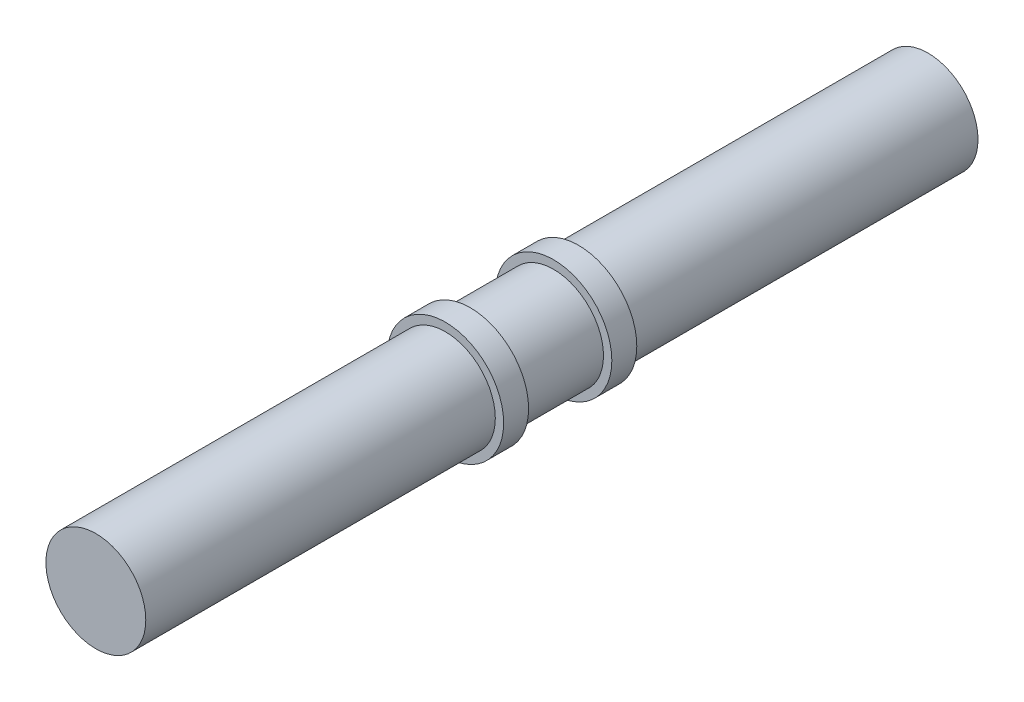
ISO-10303-21;
HEADER;
FILE_DESCRIPTION(('STEP AP214'),'2;1');
FILE_NAME('part.step','',(''),(''),'','','');
FILE_SCHEMA(('AUTOMOTIVE_DESIGN { 1 0 10303 214 1 1 1 1 }'));
ENDSEC;
DATA;
#1=APPLICATION_CONTEXT('core data for automotive mechanical design processes');
#2=APPLICATION_PROTOCOL_DEFINITION('international standard','automotive_design',2000,#1);
#3=PRODUCT_CONTEXT('',#1,'mechanical');
#4=PRODUCT('Part','Part','',(#3));
#5=PRODUCT_RELATED_PRODUCT_CATEGORY('part','',(#4));
#6=PRODUCT_DEFINITION_FORMATION('','',#4);
#7=PRODUCT_DEFINITION_CONTEXT('part definition',#1,'design');
#8=PRODUCT_DEFINITION('design','',#6,#7);
#9=PRODUCT_DEFINITION_SHAPE('','',#8);
#10=(LENGTH_UNIT() NAMED_UNIT(*) SI_UNIT(.MILLI.,.METRE.));
#11=(NAMED_UNIT(*) PLANE_ANGLE_UNIT() SI_UNIT($,.RADIAN.));
#12=(NAMED_UNIT(*) SI_UNIT($,.STERADIAN.) SOLID_ANGLE_UNIT());
#13=UNCERTAINTY_MEASURE_WITH_UNIT(LENGTH_MEASURE(1.E-05),#10,'distance_accuracy_value','');
#14=(GEOMETRIC_REPRESENTATION_CONTEXT(3) GLOBAL_UNCERTAINTY_ASSIGNED_CONTEXT((#13)) GLOBAL_UNIT_ASSIGNED_CONTEXT((#10,
#11,#12)) REPRESENTATION_CONTEXT('',''));
#15=CARTESIAN_POINT('',(0.,0.,0.));
#16=DIRECTION('',(0.,0.,1.));
#17=DIRECTION('',(1.,0.,0.));
#18=AXIS2_PLACEMENT_3D('',#15,#16,#17);
#19=CARTESIAN_POINT('',(0.,0.,42.));
#20=DIRECTION('',(0.,0.,-1.));
#21=DIRECTION('',(-1.,0.,0.));
#22=AXIS2_PLACEMENT_3D('',#19,#20,#21);
#23=CYLINDRICAL_SURFACE('',#22,6.);
#24=CARTESIAN_POINT('',(0.,0.,42.));
#25=DIRECTION('',(0.,0.,1.));
#26=DIRECTION('',(1.,0.,0.));
#27=AXIS2_PLACEMENT_3D('',#24,#25,#26);
#28=CIRCLE('',#27,6.);
#29=CARTESIAN_POINT('',(6.00000000000001,0.,42.));
#30=VERTEX_POINT('',#29);
#31=EDGE_CURVE('E56',#30,#30,#28,.T.);
#32=ORIENTED_EDGE('',*,*,#31,.F.);
#33=EDGE_LOOP('',(#32));
#34=FACE_BOUND('',#33,.T.);
#35=CARTESIAN_POINT('',(0.,0.,0.));
#36=DIRECTION('',(0.,0.,1.));
#37=DIRECTION('',(1.,0.,0.));
#38=AXIS2_PLACEMENT_3D('',#35,#36,#37);
#39=CIRCLE('',#38,6.);
#40=CARTESIAN_POINT('',(6.00000000000001,0.,0.));
#41=VERTEX_POINT('',#40);
#42=EDGE_CURVE('E44',#41,#41,#39,.T.);
#43=ORIENTED_EDGE('',*,*,#42,.T.);
#44=EDGE_LOOP('',(#43));
#45=FACE_BOUND('',#44,.T.);
#46=ADVANCED_FACE('F41',(#34,#45),#23,.T.);
#47=CARTESIAN_POINT('',(0.,0.,0.));
#48=DIRECTION('',(0.,0.,1.));
#49=DIRECTION('',(1.,0.,0.));
#50=AXIS2_PLACEMENT_3D('',#47,#48,#49);
#51=PLANE('',#50);
#52=ORIENTED_EDGE('',*,*,#42,.F.);
#53=EDGE_LOOP('',(#52));
#54=FACE_BOUND('',#53,.T.);
#55=ADVANCED_FACE('F91',(#54),#51,.F.);
#56=CARTESIAN_POINT('',(0.,0.,45.));
#57=DIRECTION('',(0.,0.,-1.));
#58=DIRECTION('',(-1.,0.,0.));
#59=AXIS2_PLACEMENT_3D('',#56,#57,#58);
#60=CYLINDRICAL_SURFACE('',#59,7.);
#61=CARTESIAN_POINT('',(0.,0.,45.));
#62=DIRECTION('',(0.,0.,1.));
#63=DIRECTION('',(1.,0.,0.));
#64=AXIS2_PLACEMENT_3D('',#61,#62,#63);
#65=CIRCLE('',#64,7.);
#66=CARTESIAN_POINT('',(7.00000000000001,0.,45.));
#67=VERTEX_POINT('',#66);
#68=EDGE_CURVE('E74',#67,#67,#65,.T.);
#69=ORIENTED_EDGE('',*,*,#68,.F.);
#70=EDGE_LOOP('',(#69));
#71=FACE_BOUND('',#70,.T.);
#72=CARTESIAN_POINT('',(0.,0.,42.));
#73=DIRECTION('',(0.,0.,1.));
#74=DIRECTION('',(1.,0.,0.));
#75=AXIS2_PLACEMENT_3D('',#72,#73,#74);
#76=CIRCLE('',#75,7.);
#77=CARTESIAN_POINT('',(7.,0.,42.));
#78=VERTEX_POINT('',#77);
#79=EDGE_CURVE('E72',#78,#78,#76,.T.);
#80=ORIENTED_EDGE('',*,*,#79,.T.);
#81=EDGE_LOOP('',(#80));
#82=FACE_BOUND('',#81,.T.);
#83=ADVANCED_FACE('F93',(#71,#82),#60,.T.);
#84=CARTESIAN_POINT('',(0.,0.,45.));
#85=DIRECTION('',(0.,0.,1.));
#86=DIRECTION('',(1.,0.,0.));
#87=AXIS2_PLACEMENT_3D('',#84,#85,#86);
#88=PLANE('',#87);
#89=CARTESIAN_POINT('',(0.,0.,45.));
#90=DIRECTION('',(0.,0.,1.));
#91=DIRECTION('',(1.,0.,0.));
#92=AXIS2_PLACEMENT_3D('',#89,#90,#91);
#93=CIRCLE('',#92,6.);
#94=CARTESIAN_POINT('',(6.00000000000001,0.,45.));
#95=VERTEX_POINT('',#94);
#96=EDGE_CURVE('E49',#95,#95,#93,.T.);
#97=ORIENTED_EDGE('',*,*,#96,.F.);
#98=EDGE_LOOP('',(#97));
#99=FACE_BOUND('',#98,.T.);
#100=ORIENTED_EDGE('',*,*,#68,.T.);
#101=EDGE_LOOP('',(#100));
#102=FACE_BOUND('',#101,.T.);
#103=ADVANCED_FACE('F98',(#99,#102),#88,.T.);
#104=CARTESIAN_POINT('',(0.,0.,42.));
#105=DIRECTION('',(0.,0.,1.));
#106=DIRECTION('',(1.,0.,0.));
#107=AXIS2_PLACEMENT_3D('',#104,#105,#106);
#108=PLANE('',#107);
#109=ORIENTED_EDGE('',*,*,#31,.T.);
#110=EDGE_LOOP('',(#109));
#111=FACE_BOUND('',#110,.T.);
#112=ORIENTED_EDGE('',*,*,#79,.F.);
#113=EDGE_LOOP('',(#112));
#114=FACE_BOUND('',#113,.T.);
#115=ADVANCED_FACE('F103',(#111,#114),#108,.F.);
#116=CARTESIAN_POINT('',(0.,0.,55.));
#117=DIRECTION('',(0.,0.,-1.));
#118=DIRECTION('',(-1.,0.,0.));
#119=AXIS2_PLACEMENT_3D('',#116,#117,#118);
#120=CYLINDRICAL_SURFACE('',#119,6.);
#121=CARTESIAN_POINT('',(0.,0.,55.));
#122=DIRECTION('',(0.,0.,1.));
#123=DIRECTION('',(1.,0.,0.));
#124=AXIS2_PLACEMENT_3D('',#121,#122,#123);
#125=CIRCLE('',#124,6.);
#126=CARTESIAN_POINT('',(6.00000000000001,0.,55.));
#127=VERTEX_POINT('',#126);
#128=EDGE_CURVE('E65',#127,#127,#125,.T.);
#129=ORIENTED_EDGE('',*,*,#128,.F.);
#130=EDGE_LOOP('',(#129));
#131=FACE_BOUND('',#130,.T.);
#132=ORIENTED_EDGE('',*,*,#96,.T.);
#133=EDGE_LOOP('',(#132));
#134=FACE_BOUND('',#133,.T.);
#135=ADVANCED_FACE('F106',(#131,#134),#120,.T.);
#136=CARTESIAN_POINT('',(0.,0.,58.));
#137=DIRECTION('',(0.,0.,-1.));
#138=DIRECTION('',(-1.,0.,0.));
#139=AXIS2_PLACEMENT_3D('',#136,#137,#138);
#140=CYLINDRICAL_SURFACE('',#139,7.);
#141=CARTESIAN_POINT('',(0.,0.,58.));
#142=DIRECTION('',(0.,0.,1.));
#143=DIRECTION('',(1.,0.,0.));
#144=AXIS2_PLACEMENT_3D('',#141,#142,#143);
#145=CIRCLE('',#144,7.);
#146=CARTESIAN_POINT('',(7.00000000000001,0.,58.));
#147=VERTEX_POINT('',#146);
#148=EDGE_CURVE('E61',#147,#147,#145,.T.);
#149=ORIENTED_EDGE('',*,*,#148,.F.);
#150=EDGE_LOOP('',(#149));
#151=FACE_BOUND('',#150,.T.);
#152=CARTESIAN_POINT('',(0.,0.,55.));
#153=DIRECTION('',(0.,0.,1.));
#154=DIRECTION('',(1.,0.,0.));
#155=AXIS2_PLACEMENT_3D('',#152,#153,#154);
#156=CIRCLE('',#155,7.);
#157=CARTESIAN_POINT('',(7.,0.,55.));
#158=VERTEX_POINT('',#157);
#159=EDGE_CURVE('E66',#158,#158,#156,.T.);
#160=ORIENTED_EDGE('',*,*,#159,.T.);
#161=EDGE_LOOP('',(#160));
#162=FACE_BOUND('',#161,.T.);
#163=ADVANCED_FACE('F112',(#151,#162),#140,.T.);
#164=CARTESIAN_POINT('',(0.,0.,58.));
#165=DIRECTION('',(0.,0.,1.));
#166=DIRECTION('',(1.,0.,0.));
#167=AXIS2_PLACEMENT_3D('',#164,#165,#166);
#168=PLANE('',#167);
#169=CARTESIAN_POINT('',(0.,0.,58.));
#170=DIRECTION('',(0.,0.,1.));
#171=DIRECTION('',(1.,0.,0.));
#172=AXIS2_PLACEMENT_3D('',#169,#170,#171);
#173=CIRCLE('',#172,6.);
#174=CARTESIAN_POINT('',(6.00000000000001,0.,58.));
#175=VERTEX_POINT('',#174);
#176=EDGE_CURVE('E10',#175,#175,#173,.T.);
#177=ORIENTED_EDGE('',*,*,#176,.F.);
#178=EDGE_LOOP('',(#177));
#179=FACE_BOUND('',#178,.T.);
#180=ORIENTED_EDGE('',*,*,#148,.T.);
#181=EDGE_LOOP('',(#180));
#182=FACE_BOUND('',#181,.T.);
#183=ADVANCED_FACE('F116',(#179,#182),#168,.T.);
#184=CARTESIAN_POINT('',(0.,0.,55.));
#185=DIRECTION('',(0.,0.,1.));
#186=DIRECTION('',(1.,0.,0.));
#187=AXIS2_PLACEMENT_3D('',#184,#185,#186);
#188=PLANE('',#187);
#189=ORIENTED_EDGE('',*,*,#128,.T.);
#190=EDGE_LOOP('',(#189));
#191=FACE_BOUND('',#190,.T.);
#192=ORIENTED_EDGE('',*,*,#159,.F.);
#193=EDGE_LOOP('',(#192));
#194=FACE_BOUND('',#193,.T.);
#195=ADVANCED_FACE('F118',(#191,#194),#188,.F.);
#196=CARTESIAN_POINT('',(0.,0.,99.9999999999999));
#197=DIRECTION('',(0.,0.,-1.));
#198=DIRECTION('',(-1.,0.,0.));
#199=AXIS2_PLACEMENT_3D('',#196,#197,#198);
#200=CYLINDRICAL_SURFACE('',#199,6.);
#201=CARTESIAN_POINT('',(0.,0.,99.9999999999999));
#202=DIRECTION('',(0.,0.,1.));
#203=DIRECTION('',(1.,0.,0.));
#204=AXIS2_PLACEMENT_3D('',#201,#202,#203);
#205=CIRCLE('',#204,6.);
#206=CARTESIAN_POINT('',(6.00000000000001,0.,99.9999999999999));
#207=VERTEX_POINT('',#206);
#208=EDGE_CURVE('E60',#207,#207,#205,.T.);
#209=ORIENTED_EDGE('',*,*,#208,.F.);
#210=EDGE_LOOP('',(#209));
#211=FACE_BOUND('',#210,.T.);
#212=ORIENTED_EDGE('',*,*,#176,.T.);
#213=EDGE_LOOP('',(#212));
#214=FACE_BOUND('',#213,.T.);
#215=ADVANCED_FACE('F121',(#211,#214),#200,.T.);
#216=CARTESIAN_POINT('',(0.,0.,99.9999999999999));
#217=DIRECTION('',(0.,0.,1.));
#218=DIRECTION('',(1.,0.,0.));
#219=AXIS2_PLACEMENT_3D('',#216,#217,#218);
#220=PLANE('',#219);
#221=ORIENTED_EDGE('',*,*,#208,.T.);
#222=EDGE_LOOP('',(#221));
#223=FACE_BOUND('',#222,.T.);
#224=ADVANCED_FACE('F128',(#223),#220,.T.);
#225=CLOSED_SHELL('',(#46,#55,#83,#103,#115,#135,#163,#183,#195,#215,#224));
#226=MANIFOLD_SOLID_BREP('B2',#225);
#227=ADVANCED_BREP_SHAPE_REPRESENTATION('',(#18,#226),#14);
#228=SHAPE_DEFINITION_REPRESENTATION(#9,#227);
ENDSEC;
END-ISO-10303-21;
